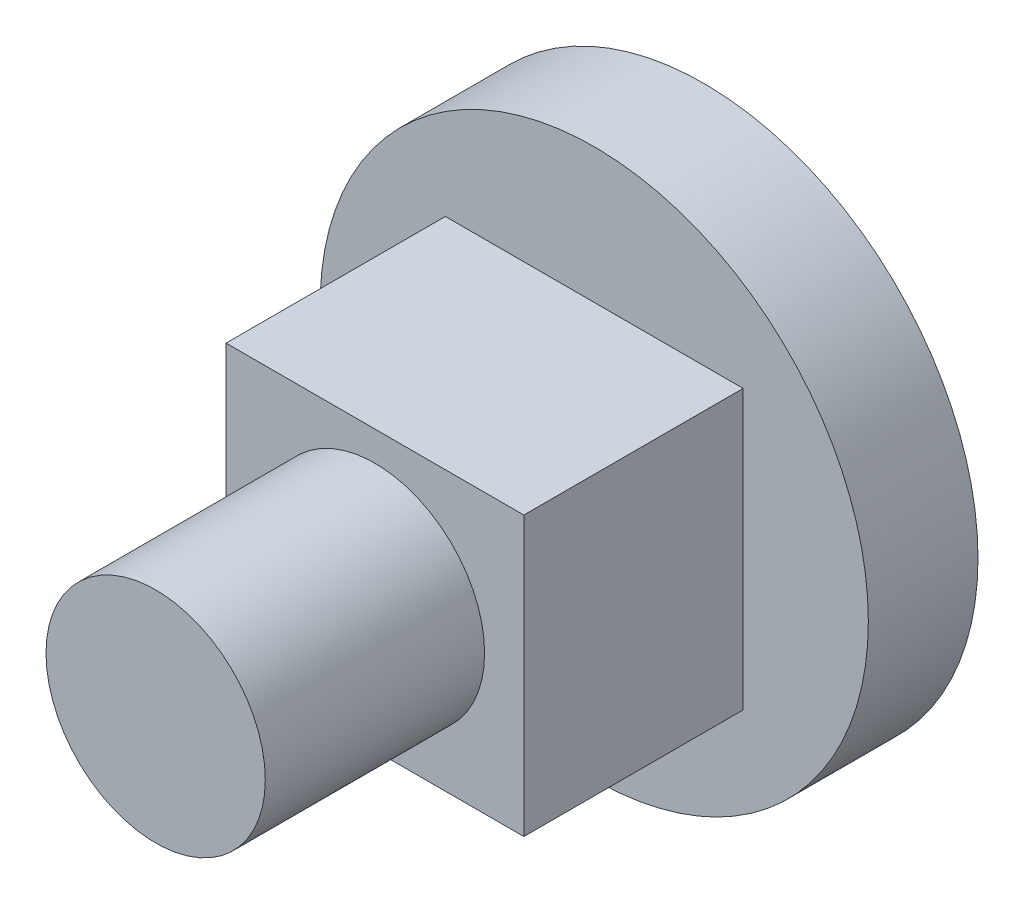
ISO-10303-21;
HEADER;
FILE_DESCRIPTION(('STEP AP214'),'2;1');
FILE_NAME('part.step','',(''),(''),'','','');
FILE_SCHEMA(('AUTOMOTIVE_DESIGN { 1 0 10303 214 1 1 1 1 }'));
ENDSEC;
DATA;
#1=APPLICATION_CONTEXT('core data for automotive mechanical design processes');
#2=APPLICATION_PROTOCOL_DEFINITION('international standard','automotive_design',2000,#1);
#3=PRODUCT_CONTEXT('',#1,'mechanical');
#4=PRODUCT('Part','Part','',(#3));
#5=PRODUCT_RELATED_PRODUCT_CATEGORY('part','',(#4));
#6=PRODUCT_DEFINITION_FORMATION('','',#4);
#7=PRODUCT_DEFINITION_CONTEXT('part definition',#1,'design');
#8=PRODUCT_DEFINITION('design','',#6,#7);
#9=PRODUCT_DEFINITION_SHAPE('','',#8);
#10=(LENGTH_UNIT() NAMED_UNIT(*) SI_UNIT(.MILLI.,.METRE.));
#11=(NAMED_UNIT(*) PLANE_ANGLE_UNIT() SI_UNIT($,.RADIAN.));
#12=(NAMED_UNIT(*) SI_UNIT($,.STERADIAN.) SOLID_ANGLE_UNIT());
#13=UNCERTAINTY_MEASURE_WITH_UNIT(LENGTH_MEASURE(1.E-05),#10,'distance_accuracy_value','');
#14=(GEOMETRIC_REPRESENTATION_CONTEXT(3) GLOBAL_UNCERTAINTY_ASSIGNED_CONTEXT((#13)) GLOBAL_UNIT_ASSIGNED_CONTEXT((#10,
#11,#12)) REPRESENTATION_CONTEXT('',''));
#15=CARTESIAN_POINT('',(0.,0.,0.));
#16=DIRECTION('',(0.,0.,1.));
#17=DIRECTION('',(1.,0.,0.));
#18=AXIS2_PLACEMENT_3D('',#15,#16,#17);
#19=CARTESIAN_POINT('',(0.,0.,5.));
#20=DIRECTION('',(0.,0.,-1.));
#21=DIRECTION('',(-1.,0.,0.));
#22=AXIS2_PLACEMENT_3D('',#19,#20,#21);
#23=CYLINDRICAL_SURFACE('',#22,1.);
#24=CARTESIAN_POINT('',(0.,0.,5.));
#25=DIRECTION('',(0.,0.,1.));
#26=DIRECTION('',(1.,0.,0.));
#27=AXIS2_PLACEMENT_3D('',#24,#25,#26);
#28=CIRCLE('',#27,1.);
#29=CARTESIAN_POINT('',(1.,0.,5.));
#30=VERTEX_POINT('',#29);
#31=EDGE_CURVE('E11',#30,#30,#28,.T.);
#32=ORIENTED_EDGE('',*,*,#31,.F.);
#33=EDGE_LOOP('',(#32));
#34=FACE_BOUND('',#33,.T.);
#35=CARTESIAN_POINT('',(0.,0.,3.));
#36=DIRECTION('',(0.,0.,1.));
#37=DIRECTION('',(1.,0.,0.));
#38=AXIS2_PLACEMENT_3D('',#35,#36,#37);
#39=CIRCLE('',#38,1.);
#40=CARTESIAN_POINT('',(1.,0.,3.));
#41=VERTEX_POINT('',#40);
#42=EDGE_CURVE('E51',#41,#41,#39,.T.);
#43=ORIENTED_EDGE('',*,*,#42,.T.);
#44=EDGE_LOOP('',(#43));
#45=FACE_BOUND('',#44,.T.);
#46=ADVANCED_FACE('F48',(#34,#45),#23,.T.);
#47=CARTESIAN_POINT('',(0.,0.,5.));
#48=DIRECTION('',(0.,0.,1.));
#49=DIRECTION('',(1.,0.,0.));
#50=AXIS2_PLACEMENT_3D('',#47,#48,#49);
#51=PLANE('',#50);
#52=ORIENTED_EDGE('',*,*,#31,.T.);
#53=EDGE_LOOP('',(#52));
#54=FACE_BOUND('',#53,.T.);
#55=ADVANCED_FACE('F63',(#54),#51,.T.);
#56=CARTESIAN_POINT('',(0.,0.,3.));
#57=DIRECTION('',(0.,0.,1.));
#58=DIRECTION('',(1.,0.,0.));
#59=AXIS2_PLACEMENT_3D('',#56,#57,#58);
#60=PLANE('',#59);
#61=ORIENTED_EDGE('',*,*,#42,.F.);
#62=EDGE_LOOP('',(#61));
#63=FACE_BOUND('',#62,.T.);
#64=ADVANCED_FACE('F61',(#63),#60,.F.);
#65=CLOSED_SHELL('',(#46,#55,#64));
#66=MANIFOLD_SOLID_BREP('B2',#65);
#67=CARTESIAN_POINT('',(0.,0.,1.));
#68=DIRECTION('',(0.,0.,-1.));
#69=DIRECTION('',(-1.,0.,0.));
#70=AXIS2_PLACEMENT_3D('',#67,#68,#69);
#71=CYLINDRICAL_SURFACE('',#70,2.5);
#72=CARTESIAN_POINT('',(0.,0.,1.));
#73=DIRECTION('',(0.,0.,1.));
#74=DIRECTION('',(1.,0.,0.));
#75=AXIS2_PLACEMENT_3D('',#72,#73,#74);
#76=CIRCLE('',#75,2.5);
#77=CARTESIAN_POINT('',(2.5,0.,1.));
#78=VERTEX_POINT('',#77);
#79=EDGE_CURVE('E47',#78,#78,#76,.T.);
#80=ORIENTED_EDGE('',*,*,#79,.F.);
#81=EDGE_LOOP('',(#80));
#82=FACE_BOUND('',#81,.T.);
#83=CARTESIAN_POINT('',(0.,0.,0.));
#84=DIRECTION('',(0.,0.,1.));
#85=DIRECTION('',(1.,0.,0.));
#86=AXIS2_PLACEMENT_3D('',#83,#84,#85);
#87=CIRCLE('',#86,2.5);
#88=CARTESIAN_POINT('',(2.5,0.,0.));
#89=VERTEX_POINT('',#88);
#90=EDGE_CURVE('E107',#89,#89,#87,.T.);
#91=ORIENTED_EDGE('',*,*,#90,.T.);
#92=EDGE_LOOP('',(#91));
#93=FACE_BOUND('',#92,.T.);
#94=ADVANCED_FACE('F104',(#82,#93),#71,.T.);
#95=CARTESIAN_POINT('',(0.,0.,1.));
#96=DIRECTION('',(0.,0.,1.));
#97=DIRECTION('',(1.,0.,0.));
#98=AXIS2_PLACEMENT_3D('',#95,#96,#97);
#99=PLANE('',#98);
#100=ORIENTED_EDGE('',*,*,#79,.T.);
#101=EDGE_LOOP('',(#100));
#102=FACE_BOUND('',#101,.T.);
#103=ADVANCED_FACE('F119',(#102),#99,.T.);
#104=CARTESIAN_POINT('',(0.,0.,0.));
#105=DIRECTION('',(0.,0.,1.));
#106=DIRECTION('',(1.,0.,0.));
#107=AXIS2_PLACEMENT_3D('',#104,#105,#106);
#108=PLANE('',#107);
#109=ORIENTED_EDGE('',*,*,#90,.F.);
#110=EDGE_LOOP('',(#109));
#111=FACE_BOUND('',#110,.T.);
#112=ADVANCED_FACE('F117',(#111),#108,.F.);
#113=CLOSED_SHELL('',(#94,#103,#112));
#114=MANIFOLD_SOLID_BREP('B6',#113);
#115=CARTESIAN_POINT('',(1.35792284982017,-1.26984050632473,3.));
#116=DIRECTION('',(0.,1.,0.));
#117=DIRECTION('',(0.,0.,1.));
#118=AXIS2_PLACEMENT_3D('',#115,#116,#117);
#119=PLANE('',#118);
#120=DIRECTION('',(1.,0.,0.));
#121=VECTOR('',#120,1.);
#122=CARTESIAN_POINT('',(1.35792284982017,-1.26984050632473,1.));
#123=LINE('',#122,#121);
#124=CARTESIAN_POINT('',(-1.35792284982017,-1.26984050632473,1.));
#125=VERTEX_POINT('',#124);
#126=CARTESIAN_POINT('',(1.35792284982017,-1.26984050632473,1.));
#127=VERTEX_POINT('',#126);
#128=EDGE_CURVE('E214',#125,#127,#123,.T.);
#129=ORIENTED_EDGE('',*,*,#128,.T.);
#130=DIRECTION('',(0.,0.,-1.));
#131=VECTOR('',#130,1.);
#132=CARTESIAN_POINT('',(1.35792284982017,-1.26984050632473,3.));
#133=LINE('',#132,#131);
#134=CARTESIAN_POINT('',(1.35792284982017,-1.26984050632473,3.));
#135=VERTEX_POINT('',#134);
#136=EDGE_CURVE('E102',#135,#127,#133,.T.);
#137=ORIENTED_EDGE('',*,*,#136,.F.);
#138=DIRECTION('',(1.,0.,0.));
#139=VECTOR('',#138,1.);
#140=CARTESIAN_POINT('',(1.35792284982017,-1.26984050632473,3.));
#141=LINE('',#140,#139);
#142=CARTESIAN_POINT('',(-1.35792284982017,-1.26984050632473,3.));
#143=VERTEX_POINT('',#142);
#144=EDGE_CURVE('E202',#143,#135,#141,.T.);
#145=ORIENTED_EDGE('',*,*,#144,.F.);
#146=DIRECTION('',(0.,0.,-1.));
#147=VECTOR('',#146,1.);
#148=CARTESIAN_POINT('',(-1.35792284982017,-1.26984050632473,3.));
#149=LINE('',#148,#147);
#150=EDGE_CURVE('E210',#143,#125,#149,.T.);
#151=ORIENTED_EDGE('',*,*,#150,.T.);
#152=EDGE_LOOP('',(#129,#137,#145,#151));
#153=FACE_BOUND('',#152,.T.);
#154=ADVANCED_FACE('F151',(#153),#119,.F.);
#155=CARTESIAN_POINT('',(1.35792284982017,-1.26984050632473,3.));
#156=DIRECTION('',(-1.,0.,0.));
#157=DIRECTION('',(0.,0.,1.));
#158=AXIS2_PLACEMENT_3D('',#155,#156,#157);
#159=PLANE('',#158);
#160=DIRECTION('',(0.,1.,0.));
#161=VECTOR('',#160,1.);
#162=CARTESIAN_POINT('',(1.35792284982017,-1.26984050632473,1.));
#163=LINE('',#162,#161);
#164=CARTESIAN_POINT('',(1.35792284982017,1.26984050632473,1.));
#165=VERTEX_POINT('',#164);
#166=EDGE_CURVE('E206',#127,#165,#163,.T.);
#167=ORIENTED_EDGE('',*,*,#166,.T.);
#168=DIRECTION('',(0.,0.,-1.));
#169=VECTOR('',#168,1.);
#170=CARTESIAN_POINT('',(1.35792284982017,1.26984050632473,3.));
#171=LINE('',#170,#169);
#172=CARTESIAN_POINT('',(1.35792284982017,1.26984050632473,3.));
#173=VERTEX_POINT('',#172);
#174=EDGE_CURVE('E159',#173,#165,#171,.T.);
#175=ORIENTED_EDGE('',*,*,#174,.F.);
#176=DIRECTION('',(0.,1.,0.));
#177=VECTOR('',#176,1.);
#178=CARTESIAN_POINT('',(1.35792284982017,-1.26984050632473,3.));
#179=LINE('',#178,#177);
#180=EDGE_CURVE('E197',#135,#173,#179,.T.);
#181=ORIENTED_EDGE('',*,*,#180,.F.);
#182=ORIENTED_EDGE('',*,*,#136,.T.);
#183=EDGE_LOOP('',(#167,#175,#181,#182));
#184=FACE_BOUND('',#183,.T.);
#185=ADVANCED_FACE('F205',(#184),#159,.F.);
#186=CARTESIAN_POINT('',(1.35792284982017,1.26984050632473,3.));
#187=DIRECTION('',(0.,-1.,0.));
#188=DIRECTION('',(0.,0.,-1.));
#189=AXIS2_PLACEMENT_3D('',#186,#187,#188);
#190=PLANE('',#189);
#191=DIRECTION('',(-1.,0.,0.));
#192=VECTOR('',#191,1.);
#193=CARTESIAN_POINT('',(1.35792284982017,1.26984050632473,1.));
#194=LINE('',#193,#192);
#195=CARTESIAN_POINT('',(-1.35792284982017,1.26984050632473,1.));
#196=VERTEX_POINT('',#195);
#197=EDGE_CURVE('E184',#165,#196,#194,.T.);
#198=ORIENTED_EDGE('',*,*,#197,.T.);
#199=DIRECTION('',(0.,0.,-1.));
#200=VECTOR('',#199,1.);
#201=CARTESIAN_POINT('',(-1.35792284982017,1.26984050632473,3.));
#202=LINE('',#201,#200);
#203=CARTESIAN_POINT('',(-1.35792284982017,1.26984050632473,3.));
#204=VERTEX_POINT('',#203);
#205=EDGE_CURVE('E207',#204,#196,#202,.T.);
#206=ORIENTED_EDGE('',*,*,#205,.F.);
#207=DIRECTION('',(-1.,0.,0.));
#208=VECTOR('',#207,1.);
#209=CARTESIAN_POINT('',(1.35792284982017,1.26984050632473,3.));
#210=LINE('',#209,#208);
#211=EDGE_CURVE('E200',#173,#204,#210,.T.);
#212=ORIENTED_EDGE('',*,*,#211,.F.);
#213=ORIENTED_EDGE('',*,*,#174,.T.);
#214=EDGE_LOOP('',(#198,#206,#212,#213));
#215=FACE_BOUND('',#214,.T.);
#216=ADVANCED_FACE('F208',(#215),#190,.F.);
#217=CARTESIAN_POINT('',(-1.35792284982017,-1.26984050632473,3.));
#218=DIRECTION('',(1.,0.,0.));
#219=DIRECTION('',(0.,0.,-1.));
#220=AXIS2_PLACEMENT_3D('',#217,#218,#219);
#221=PLANE('',#220);
#222=DIRECTION('',(0.,-1.,0.));
#223=VECTOR('',#222,1.);
#224=CARTESIAN_POINT('',(-1.35792284982017,-1.26984050632473,1.));
#225=LINE('',#224,#223);
#226=EDGE_CURVE('E190',#196,#125,#225,.T.);
#227=ORIENTED_EDGE('',*,*,#226,.T.);
#228=ORIENTED_EDGE('',*,*,#150,.F.);
#229=DIRECTION('',(0.,-1.,0.));
#230=VECTOR('',#229,1.);
#231=CARTESIAN_POINT('',(-1.35792284982017,-1.26984050632473,3.));
#232=LINE('',#231,#230);
#233=EDGE_CURVE('E167',#204,#143,#232,.T.);
#234=ORIENTED_EDGE('',*,*,#233,.F.);
#235=ORIENTED_EDGE('',*,*,#205,.T.);
#236=EDGE_LOOP('',(#227,#228,#234,#235));
#237=FACE_BOUND('',#236,.T.);
#238=ADVANCED_FACE('F221',(#237),#221,.F.);
#239=CARTESIAN_POINT('',(0.,0.,3.));
#240=DIRECTION('',(0.,0.,-1.));
#241=DIRECTION('',(-1.,0.,0.));
#242=AXIS2_PLACEMENT_3D('',#239,#240,#241);
#243=PLANE('',#242);
#244=ORIENTED_EDGE('',*,*,#144,.T.);
#245=ORIENTED_EDGE('',*,*,#180,.T.);
#246=ORIENTED_EDGE('',*,*,#211,.T.);
#247=ORIENTED_EDGE('',*,*,#233,.T.);
#248=EDGE_LOOP('',(#244,#245,#246,#247));
#249=FACE_BOUND('',#248,.T.);
#250=ADVANCED_FACE('F198',(#249),#243,.F.);
#251=CARTESIAN_POINT('',(0.,0.,1.));
#252=DIRECTION('',(0.,0.,-1.));
#253=DIRECTION('',(-1.,0.,0.));
#254=AXIS2_PLACEMENT_3D('',#251,#252,#253);
#255=PLANE('',#254);
#256=ORIENTED_EDGE('',*,*,#128,.F.);
#257=ORIENTED_EDGE('',*,*,#226,.F.);
#258=ORIENTED_EDGE('',*,*,#197,.F.);
#259=ORIENTED_EDGE('',*,*,#166,.F.);
#260=EDGE_LOOP('',(#256,#257,#258,#259));
#261=FACE_BOUND('',#260,.T.);
#262=ADVANCED_FACE('F224',(#261),#255,.T.);
#263=CLOSED_SHELL('',(#154,#185,#216,#238,#250,#262));
#264=MANIFOLD_SOLID_BREP('B42',#263);
#265=ADVANCED_BREP_SHAPE_REPRESENTATION('',(#18,#66,#114,#264),#14);
#266=SHAPE_DEFINITION_REPRESENTATION(#9,#265);
ENDSEC;
END-ISO-10303-21;
